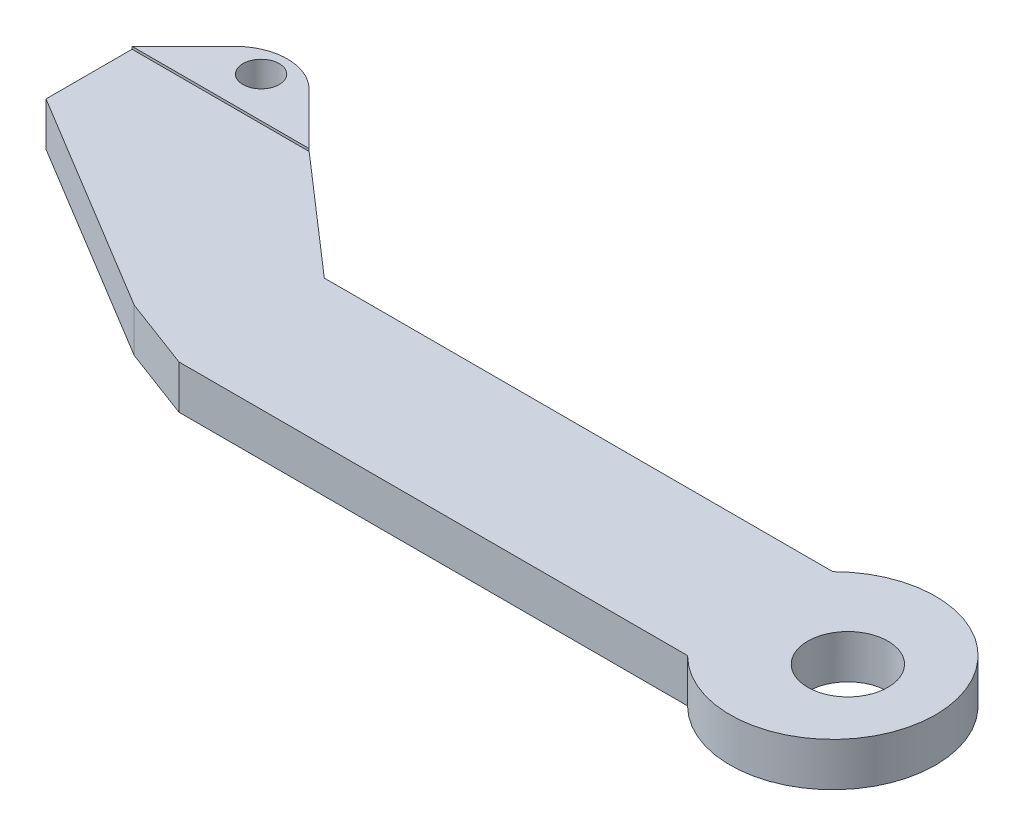
ISO-10303-21;
HEADER;
FILE_DESCRIPTION(('STEP AP214'),'2;1');
FILE_NAME('part.step','',(''),(''),'','','');
FILE_SCHEMA(('AUTOMOTIVE_DESIGN { 1 0 10303 214 1 1 1 1 }'));
ENDSEC;
DATA;
#1=APPLICATION_CONTEXT('core data for automotive mechanical design processes');
#2=APPLICATION_PROTOCOL_DEFINITION('international standard','automotive_design',2000,#1);
#3=PRODUCT_CONTEXT('',#1,'mechanical');
#4=PRODUCT('Part','Part','',(#3));
#5=PRODUCT_RELATED_PRODUCT_CATEGORY('part','',(#4));
#6=PRODUCT_DEFINITION_FORMATION('','',#4);
#7=PRODUCT_DEFINITION_CONTEXT('part definition',#1,'design');
#8=PRODUCT_DEFINITION('design','',#6,#7);
#9=PRODUCT_DEFINITION_SHAPE('','',#8);
#10=(LENGTH_UNIT() NAMED_UNIT(*) SI_UNIT(.MILLI.,.METRE.));
#11=(NAMED_UNIT(*) PLANE_ANGLE_UNIT() SI_UNIT($,.RADIAN.));
#12=(NAMED_UNIT(*) SI_UNIT($,.STERADIAN.) SOLID_ANGLE_UNIT());
#13=UNCERTAINTY_MEASURE_WITH_UNIT(LENGTH_MEASURE(1.E-05),#10,'distance_accuracy_value','');
#14=(GEOMETRIC_REPRESENTATION_CONTEXT(3) GLOBAL_UNCERTAINTY_ASSIGNED_CONTEXT((#13)) GLOBAL_UNIT_ASSIGNED_CONTEXT((#10,
#11,#12)) REPRESENTATION_CONTEXT('',''));
#15=CARTESIAN_POINT('',(0.,0.,0.));
#16=DIRECTION('',(0.,0.,1.));
#17=DIRECTION('',(1.,0.,0.));
#18=AXIS2_PLACEMENT_3D('',#15,#16,#17);
#19=CARTESIAN_POINT('',(70.,6.,-20.));
#20=DIRECTION('',(0.,0.,1.));
#21=DIRECTION('',(1.,0.,0.));
#22=AXIS2_PLACEMENT_3D('',#19,#20,#21);
#23=PLANE('',#22);
#24=DIRECTION('',(-1.,0.,0.));
#25=VECTOR('',#24,1.);
#26=CARTESIAN_POINT('',(70.,0.,-20.));
#27=LINE('',#26,#25);
#28=CARTESIAN_POINT('',(70.,0.,-20.));
#29=VERTEX_POINT('',#28);
#30=CARTESIAN_POINT('',(0.,0.,-20.));
#31=VERTEX_POINT('',#30);
#32=EDGE_CURVE('E132',#29,#31,#27,.T.);
#33=ORIENTED_EDGE('',*,*,#32,.T.);
#34=DIRECTION('',(0.,-1.,0.));
#35=VECTOR('',#34,1.);
#36=CARTESIAN_POINT('',(0.,6.,-20.));
#37=LINE('',#36,#35);
#38=CARTESIAN_POINT('',(0.,6.,-20.));
#39=VERTEX_POINT('',#38);
#40=EDGE_CURVE('E11',#39,#31,#37,.T.);
#41=ORIENTED_EDGE('',*,*,#40,.F.);
#42=DIRECTION('',(-1.,0.,0.));
#43=VECTOR('',#42,1.);
#44=CARTESIAN_POINT('',(70.,6.,-20.));
#45=LINE('',#44,#43);
#46=CARTESIAN_POINT('',(70.,6.,-20.));
#47=VERTEX_POINT('',#46);
#48=EDGE_CURVE('E146',#47,#39,#45,.T.);
#49=ORIENTED_EDGE('',*,*,#48,.F.);
#50=DIRECTION('',(0.,-1.,0.));
#51=VECTOR('',#50,1.);
#52=CARTESIAN_POINT('',(70.,6.,-20.));
#53=LINE('',#52,#51);
#54=EDGE_CURVE('E50',#47,#29,#53,.T.);
#55=ORIENTED_EDGE('',*,*,#54,.T.);
#56=EDGE_LOOP('',(#33,#41,#49,#55));
#57=FACE_BOUND('',#56,.T.);
#58=ADVANCED_FACE('F33',(#57),#23,.F.);
#59=CARTESIAN_POINT('',(0.,6.,-20.));
#60=DIRECTION('',(-0.656674069565782,0.,0.754174493310345));
#61=DIRECTION('',(0.754174493310345,0.,0.656674069565782));
#62=AXIS2_PLACEMENT_3D('',#59,#60,#61);
#63=PLANE('',#62);
#64=DIRECTION('',(-0.754174493310344,0.,-0.656674069565782));
#65=VECTOR('',#64,1.);
#66=CARTESIAN_POINT('',(0.,0.,-20.));
#67=LINE('',#66,#65);
#68=CARTESIAN_POINT('',(-16.1290992803304,0.,-34.0439133871459));
#69=VERTEX_POINT('',#68);
#70=EDGE_CURVE('E134',#31,#69,#67,.T.);
#71=ORIENTED_EDGE('',*,*,#70,.T.);
#72=DIRECTION('',(0.,-1.,0.));
#73=VECTOR('',#72,1.);
#74=CARTESIAN_POINT('',(-16.1290992803304,6.,-34.0439133871459));
#75=LINE('',#74,#73);
#76=CARTESIAN_POINT('',(-16.1290992803304,6.,-34.0439133871459));
#77=VERTEX_POINT('',#76);
#78=EDGE_CURVE('E42',#77,#69,#75,.T.);
#79=ORIENTED_EDGE('',*,*,#78,.F.);
#80=DIRECTION('',(-0.754174493310344,0.,-0.656674069565782));
#81=VECTOR('',#80,1.);
#82=CARTESIAN_POINT('',(0.,6.,-20.));
#83=LINE('',#82,#81);
#84=EDGE_CURVE('E90',#39,#77,#83,.T.);
#85=ORIENTED_EDGE('',*,*,#84,.F.);
#86=ORIENTED_EDGE('',*,*,#40,.T.);
#87=EDGE_LOOP('',(#71,#79,#85,#86));
#88=FACE_BOUND('',#87,.T.);
#89=ADVANCED_FACE('F228',(#88),#63,.F.);
#90=CARTESIAN_POINT('',(-40.5079542623739,6.,-34.0439133871459));
#91=DIRECTION('',(1.,0.,0.));
#92=DIRECTION('',(0.,0.,-1.));
#93=AXIS2_PLACEMENT_3D('',#90,#91,#92);
#94=PLANE('',#93);
#95=DIRECTION('',(0.,0.,1.));
#96=VECTOR('',#95,1.);
#97=CARTESIAN_POINT('',(-40.5079542623739,0.,-34.0439133871459));
#98=LINE('',#97,#96);
#99=CARTESIAN_POINT('',(-40.5079542623739,0.,-34.0439133871459));
#100=VERTEX_POINT('',#99);
#101=CARTESIAN_POINT('',(-40.5079542623739,0.,-22.1996269975087));
#102=VERTEX_POINT('',#101);
#103=EDGE_CURVE('E136',#100,#102,#98,.T.);
#104=ORIENTED_EDGE('',*,*,#103,.T.);
#105=DIRECTION('',(0.,-1.,0.));
#106=VECTOR('',#105,1.);
#107=CARTESIAN_POINT('',(-40.5079542623739,6.,-22.1996269975087));
#108=LINE('',#107,#106);
#109=CARTESIAN_POINT('',(-40.5079542623739,6.,-22.1996269975087));
#110=VERTEX_POINT('',#109);
#111=EDGE_CURVE('E150',#110,#102,#108,.T.);
#112=ORIENTED_EDGE('',*,*,#111,.F.);
#113=DIRECTION('',(0.,0.,1.));
#114=VECTOR('',#113,1.);
#115=CARTESIAN_POINT('',(-40.5079542623739,6.,-34.0439133871459));
#116=LINE('',#115,#114);
#117=CARTESIAN_POINT('',(-40.5079542623739,6.,-34.0439133871459));
#118=VERTEX_POINT('',#117);
#119=EDGE_CURVE('E206',#118,#110,#116,.T.);
#120=ORIENTED_EDGE('',*,*,#119,.F.);
#121=DIRECTION('',(0.,-1.,0.));
#122=VECTOR('',#121,1.);
#123=CARTESIAN_POINT('',(-40.5079542623739,6.,-34.0439133871459));
#124=LINE('',#123,#122);
#125=EDGE_CURVE('E153',#118,#100,#124,.T.);
#126=ORIENTED_EDGE('',*,*,#125,.T.);
#127=EDGE_LOOP('',(#104,#112,#120,#126));
#128=FACE_BOUND('',#127,.T.);
#129=ADVANCED_FACE('F211',(#128),#94,.F.);
#130=CARTESIAN_POINT('',(-40.5079542623739,6.,-22.1996269975087));
#131=DIRECTION('',(0.516906923938447,0.,-0.856041606456423));
#132=DIRECTION('',(-0.856041606456423,0.,-0.516906923938447));
#133=AXIS2_PLACEMENT_3D('',#130,#131,#132);
#134=PLANE('',#133);
#135=DIRECTION('',(0.856041606456423,0.,0.516906923938447));
#136=VECTOR('',#135,1.);
#137=CARTESIAN_POINT('',(-40.5079542623739,0.,-22.1996269975087));
#138=LINE('',#137,#136);
#139=CARTESIAN_POINT('',(-9.85011104348674,0.,-3.68738260034483));
#140=VERTEX_POINT('',#139);
#141=EDGE_CURVE('E138',#102,#140,#138,.T.);
#142=ORIENTED_EDGE('',*,*,#141,.T.);
#143=DIRECTION('',(0.,-1.,0.));
#144=VECTOR('',#143,1.);
#145=CARTESIAN_POINT('',(-9.85011104348674,6.,-3.68738260034483));
#146=LINE('',#145,#144);
#147=CARTESIAN_POINT('',(-9.85011104348674,6.,-3.68738260034483));
#148=VERTEX_POINT('',#147);
#149=EDGE_CURVE('E124',#148,#140,#146,.T.);
#150=ORIENTED_EDGE('',*,*,#149,.F.);
#151=DIRECTION('',(0.856041606456423,0.,0.516906923938447));
#152=VECTOR('',#151,1.);
#153=CARTESIAN_POINT('',(-40.5079542623739,6.,-22.1996269975087));
#154=LINE('',#153,#152);
#155=EDGE_CURVE('E112',#110,#148,#154,.T.);
#156=ORIENTED_EDGE('',*,*,#155,.F.);
#157=ORIENTED_EDGE('',*,*,#111,.T.);
#158=EDGE_LOOP('',(#142,#150,#156,#157));
#159=FACE_BOUND('',#158,.T.);
#160=ADVANCED_FACE('F215',(#159),#134,.F.);
#161=CARTESIAN_POINT('',(-9.85011104348674,6.,-3.68738260034483));
#162=DIRECTION('',(0.350589151778584,0.,-0.936529362409515));
#163=DIRECTION('',(-0.936529362409515,0.,-0.350589151778584));
#164=AXIS2_PLACEMENT_3D('',#161,#162,#163);
#165=PLANE('',#164);
#166=DIRECTION('',(0.936529362409515,0.,0.350589151778584));
#167=VECTOR('',#166,1.);
#168=CARTESIAN_POINT('',(-9.85011104348674,0.,-3.68738260034483));
#169=LINE('',#168,#167);
#170=CARTESIAN_POINT('',(0.,0.,0.));
#171=VERTEX_POINT('',#170);
#172=EDGE_CURVE('E121',#140,#171,#169,.T.);
#173=ORIENTED_EDGE('',*,*,#172,.T.);
#174=DIRECTION('',(0.,-1.,0.));
#175=VECTOR('',#174,1.);
#176=CARTESIAN_POINT('',(0.,6.,0.));
#177=LINE('',#176,#175);
#178=CARTESIAN_POINT('',(0.,6.,0.));
#179=VERTEX_POINT('',#178);
#180=EDGE_CURVE('E118',#179,#171,#177,.T.);
#181=ORIENTED_EDGE('',*,*,#180,.F.);
#182=DIRECTION('',(0.936529362409515,0.,0.350589151778584));
#183=VECTOR('',#182,1.);
#184=CARTESIAN_POINT('',(-9.85011104348674,6.,-3.68738260034483));
#185=LINE('',#184,#183);
#186=EDGE_CURVE('E105',#148,#179,#185,.T.);
#187=ORIENTED_EDGE('',*,*,#186,.F.);
#188=ORIENTED_EDGE('',*,*,#149,.T.);
#189=EDGE_LOOP('',(#173,#181,#187,#188));
#190=FACE_BOUND('',#189,.T.);
#191=ADVANCED_FACE('F119',(#190),#165,.F.);
#192=CARTESIAN_POINT('',(0.,6.,0.));
#193=DIRECTION('',(0.,0.,-1.));
#194=DIRECTION('',(-1.,0.,0.));
#195=AXIS2_PLACEMENT_3D('',#192,#193,#194);
#196=PLANE('',#195);
#197=DIRECTION('',(1.,0.,0.));
#198=VECTOR('',#197,1.);
#199=CARTESIAN_POINT('',(0.,0.,0.));
#200=LINE('',#199,#198);
#201=CARTESIAN_POINT('',(70.,0.,0.));
#202=VERTEX_POINT('',#201);
#203=EDGE_CURVE('E141',#171,#202,#200,.T.);
#204=ORIENTED_EDGE('',*,*,#203,.T.);
#205=DIRECTION('',(0.,-1.,0.));
#206=VECTOR('',#205,1.);
#207=CARTESIAN_POINT('',(70.,6.,0.));
#208=LINE('',#207,#206);
#209=CARTESIAN_POINT('',(70.,6.,0.));
#210=VERTEX_POINT('',#209);
#211=EDGE_CURVE('E78',#210,#202,#208,.T.);
#212=ORIENTED_EDGE('',*,*,#211,.F.);
#213=DIRECTION('',(1.,0.,0.));
#214=VECTOR('',#213,1.);
#215=CARTESIAN_POINT('',(0.,6.,0.));
#216=LINE('',#215,#214);
#217=EDGE_CURVE('E110',#179,#210,#216,.T.);
#218=ORIENTED_EDGE('',*,*,#217,.F.);
#219=ORIENTED_EDGE('',*,*,#180,.T.);
#220=EDGE_LOOP('',(#204,#212,#218,#219));
#221=FACE_BOUND('',#220,.T.);
#222=ADVANCED_FACE('F126',(#221),#196,.F.);
#223=CARTESIAN_POINT('',(80.,6.,-10.));
#224=DIRECTION('',(0.,-1.,0.));
#225=DIRECTION('',(0.,0.,-1.));
#226=AXIS2_PLACEMENT_3D('',#223,#224,#225);
#227=CYLINDRICAL_SURFACE('',#226,14.142135623731);
#228=CARTESIAN_POINT('',(80.,0.,-10.));
#229=DIRECTION('',(0.,-1.,0.));
#230=DIRECTION('',(0.,0.,-1.));
#231=AXIS2_PLACEMENT_3D('',#228,#229,#230);
#232=CIRCLE('',#231,14.142135623731);
#233=EDGE_CURVE('E143',#29,#202,#232,.T.);
#234=ORIENTED_EDGE('',*,*,#233,.F.);
#235=ORIENTED_EDGE('',*,*,#54,.F.);
#236=CARTESIAN_POINT('',(80.,6.,-10.));
#237=DIRECTION('',(0.,-1.,0.));
#238=DIRECTION('',(0.,0.,-1.));
#239=AXIS2_PLACEMENT_3D('',#236,#237,#238);
#240=CIRCLE('',#239,14.142135623731);
#241=EDGE_CURVE('E127',#47,#210,#240,.T.);
#242=ORIENTED_EDGE('',*,*,#241,.T.);
#243=ORIENTED_EDGE('',*,*,#211,.T.);
#244=EDGE_LOOP('',(#234,#235,#242,#243));
#245=FACE_BOUND('',#244,.T.);
#246=ADVANCED_FACE('F216',(#245),#227,.T.);
#247=CARTESIAN_POINT('',(80.,6.,-10.));
#248=DIRECTION('',(0.,-1.,0.));
#249=DIRECTION('',(0.,0.,-1.));
#250=AXIS2_PLACEMENT_3D('',#247,#248,#249);
#251=PLANE('',#250);
#252=CARTESIAN_POINT('',(82.0710678118655,6.,-10.));
#253=DIRECTION('',(0.,1.,0.));
#254=DIRECTION('',(0.,0.,1.));
#255=AXIS2_PLACEMENT_3D('',#252,#253,#254);
#256=CIRCLE('',#255,5.51790000000001);
#257=CARTESIAN_POINT('',(82.0710678118655,6.,-4.4821));
#258=VERTEX_POINT('',#257);
#259=EDGE_CURVE('E198',#258,#258,#256,.T.);
#260=ORIENTED_EDGE('',*,*,#259,.F.);
#261=EDGE_LOOP('',(#260));
#262=FACE_BOUND('',#261,.T.);
#263=ORIENTED_EDGE('',*,*,#48,.T.);
#264=ORIENTED_EDGE('',*,*,#84,.T.);
#265=DIRECTION('',(1.,0.,0.));
#266=VECTOR('',#265,1.);
#267=CARTESIAN_POINT('',(-40.5079542623739,6.,-34.0439133871459));
#268=LINE('',#267,#266);
#269=EDGE_CURVE('E203',#118,#77,#268,.T.);
#270=ORIENTED_EDGE('',*,*,#269,.F.);
#271=ORIENTED_EDGE('',*,*,#119,.T.);
#272=ORIENTED_EDGE('',*,*,#155,.T.);
#273=ORIENTED_EDGE('',*,*,#186,.T.);
#274=ORIENTED_EDGE('',*,*,#217,.T.);
#275=ORIENTED_EDGE('',*,*,#241,.F.);
#276=EDGE_LOOP('',(#263,#264,#270,#271,#272,#273,#274,#275));
#277=FACE_BOUND('',#276,.T.);
#278=ADVANCED_FACE('F107',(#262,#277),#251,.F.);
#279=CARTESIAN_POINT('',(80.,0.,-10.));
#280=DIRECTION('',(0.,-1.,0.));
#281=DIRECTION('',(0.,0.,-1.));
#282=AXIS2_PLACEMENT_3D('',#279,#280,#281);
#283=PLANE('',#282);
#284=CARTESIAN_POINT('',(82.0710678118655,0.,-10.));
#285=DIRECTION('',(0.,-1.,0.));
#286=DIRECTION('',(0.,0.,-1.));
#287=AXIS2_PLACEMENT_3D('',#284,#285,#286);
#288=CIRCLE('',#287,5.51790000000001);
#289=CARTESIAN_POINT('',(82.0710678118655,0.,-15.5179));
#290=VERTEX_POINT('',#289);
#291=EDGE_CURVE('E36',#290,#290,#288,.T.);
#292=ORIENTED_EDGE('',*,*,#291,.F.);
#293=EDGE_LOOP('',(#292));
#294=FACE_BOUND('',#293,.T.);
#295=ORIENTED_EDGE('',*,*,#32,.F.);
#296=ORIENTED_EDGE('',*,*,#233,.T.);
#297=ORIENTED_EDGE('',*,*,#203,.F.);
#298=ORIENTED_EDGE('',*,*,#172,.F.);
#299=ORIENTED_EDGE('',*,*,#141,.F.);
#300=ORIENTED_EDGE('',*,*,#103,.F.);
#301=DIRECTION('',(-0.707106781186551,0.,0.707106781186544));
#302=VECTOR('',#301,1.);
#303=CARTESIAN_POINT('',(-40.5079542623739,0.,-34.0439133871459));
#304=LINE('',#303,#302);
#305=CARTESIAN_POINT('',(-33.4368864505084,0.,-41.1149811990113));
#306=VERTEX_POINT('',#305);
#307=EDGE_CURVE('E177',#306,#100,#304,.T.);
#308=ORIENTED_EDGE('',*,*,#307,.F.);
#309=CARTESIAN_POINT('',(-28.3185267713521,0.,-35.9966215198552));
#310=DIRECTION('',(0.,1.,0.));
#311=DIRECTION('',(0.,0.,1.));
#312=AXIS2_PLACEMENT_3D('',#309,#310,#311);
#313=CIRCLE('',#312,7.2384536753663);
#314=CARTESIAN_POINT('',(-23.2001670921959,0.,-41.1149811990114));
#315=VERTEX_POINT('',#314);
#316=EDGE_CURVE('E174',#315,#306,#313,.T.);
#317=ORIENTED_EDGE('',*,*,#316,.F.);
#318=DIRECTION('',(-0.707106781186547,0.,-0.707106781186548));
#319=VECTOR('',#318,1.);
#320=CARTESIAN_POINT('',(-16.1290992803304,0.,-34.0439133871459));
#321=LINE('',#320,#319);
#322=EDGE_CURVE('E163',#69,#315,#321,.T.);
#323=ORIENTED_EDGE('',*,*,#322,.F.);
#324=ORIENTED_EDGE('',*,*,#70,.F.);
#325=EDGE_LOOP('',(#295,#296,#297,#298,#299,#300,#308,#317,#323,#324));
#326=FACE_BOUND('',#325,.T.);
#327=CARTESIAN_POINT('',(-28.3185267713521,0.,-39.6158483575383));
#328=DIRECTION('',(0.,1.,0.));
#329=DIRECTION('',(0.,0.,1.));
#330=AXIS2_PLACEMENT_3D('',#327,#328,#329);
#331=CIRCLE('',#330,2.5);
#332=CARTESIAN_POINT('',(-28.3185267713521,0.,-37.1158483575383));
#333=VERTEX_POINT('',#332);
#334=EDGE_CURVE('E180',#333,#333,#331,.T.);
#335=ORIENTED_EDGE('',*,*,#334,.T.);
#336=EDGE_LOOP('',(#335));
#337=FACE_BOUND('',#336,.T.);
#338=ADVANCED_FACE('F170',(#294,#326,#337),#283,.T.);
#339=CARTESIAN_POINT('',(82.0710678118655,-0.35,-10.));
#340=DIRECTION('',(0.,1.,0.));
#341=DIRECTION('',(0.,0.,1.));
#342=AXIS2_PLACEMENT_3D('',#339,#340,#341);
#343=CYLINDRICAL_SURFACE('',#342,5.51790000000001);
#344=ORIENTED_EDGE('',*,*,#291,.T.);
#345=EDGE_LOOP('',(#344));
#346=FACE_BOUND('',#345,.T.);
#347=ORIENTED_EDGE('',*,*,#259,.T.);
#348=EDGE_LOOP('',(#347));
#349=FACE_BOUND('',#348,.T.);
#350=ADVANCED_FACE('F286',(#346,#349),#343,.F.);
#351=CARTESIAN_POINT('',(-16.1290992803304,6.35,-34.0439133871459));
#352=DIRECTION('',(0.,0.,-1.));
#353=DIRECTION('',(-1.,0.,0.));
#354=AXIS2_PLACEMENT_3D('',#351,#352,#353);
#355=PLANE('',#354);
#356=DIRECTION('',(0.,-1.,0.));
#357=VECTOR('',#356,1.);
#358=CARTESIAN_POINT('',(-40.5079542623739,6.35,-34.0439133871459));
#359=LINE('',#358,#357);
#360=CARTESIAN_POINT('',(-40.5079542623739,6.35,-34.0439133871459));
#361=VERTEX_POINT('',#360);
#362=EDGE_CURVE('E189',#361,#118,#359,.T.);
#363=ORIENTED_EDGE('',*,*,#362,.T.);
#364=ORIENTED_EDGE('',*,*,#269,.T.);
#365=DIRECTION('',(0.,-1.,0.));
#366=VECTOR('',#365,1.);
#367=CARTESIAN_POINT('',(-16.1290992803304,6.35,-34.0439133871459));
#368=LINE('',#367,#366);
#369=CARTESIAN_POINT('',(-16.1290992803304,6.35,-34.0439133871459));
#370=VERTEX_POINT('',#369);
#371=EDGE_CURVE('E167',#370,#77,#368,.T.);
#372=ORIENTED_EDGE('',*,*,#371,.F.);
#373=DIRECTION('',(1.,0.,0.));
#374=VECTOR('',#373,1.);
#375=CARTESIAN_POINT('',(-16.1290992803304,6.35,-34.0439133871459));
#376=LINE('',#375,#374);
#377=EDGE_CURVE('E188',#361,#370,#376,.T.);
#378=ORIENTED_EDGE('',*,*,#377,.F.);
#379=EDGE_LOOP('',(#363,#364,#372,#378));
#380=FACE_BOUND('',#379,.T.);
#381=ADVANCED_FACE('F235',(#380),#355,.F.);
#382=CARTESIAN_POINT('',(-28.3185267713521,6.35,-35.9966215198552));
#383=DIRECTION('',(0.,1.,0.));
#384=DIRECTION('',(0.,0.,1.));
#385=AXIS2_PLACEMENT_3D('',#382,#383,#384);
#386=PLANE('',#385);
#387=ORIENTED_EDGE('',*,*,#377,.T.);
#388=DIRECTION('',(-0.707106781186547,0.,-0.707106781186548));
#389=VECTOR('',#388,1.);
#390=CARTESIAN_POINT('',(-16.1290992803304,6.35,-34.0439133871459));
#391=LINE('',#390,#389);
#392=CARTESIAN_POINT('',(-23.2001670921959,6.35,-41.1149811990114));
#393=VERTEX_POINT('',#392);
#394=EDGE_CURVE('E257',#370,#393,#391,.T.);
#395=ORIENTED_EDGE('',*,*,#394,.T.);
#396=CARTESIAN_POINT('',(-28.3185267713521,6.35,-35.9966215198552));
#397=DIRECTION('',(0.,1.,0.));
#398=DIRECTION('',(0.,0.,1.));
#399=AXIS2_PLACEMENT_3D('',#396,#397,#398);
#400=CIRCLE('',#399,7.2384536753663);
#401=CARTESIAN_POINT('',(-33.4368864505084,6.35,-41.1149811990113));
#402=VERTEX_POINT('',#401);
#403=EDGE_CURVE('E261',#393,#402,#400,.T.);
#404=ORIENTED_EDGE('',*,*,#403,.T.);
#405=DIRECTION('',(-0.707106781186551,0.,0.707106781186544));
#406=VECTOR('',#405,1.);
#407=CARTESIAN_POINT('',(-40.5079542623739,6.35,-34.0439133871459));
#408=LINE('',#407,#406);
#409=EDGE_CURVE('E183',#402,#361,#408,.T.);
#410=ORIENTED_EDGE('',*,*,#409,.T.);
#411=EDGE_LOOP('',(#387,#395,#404,#410));
#412=FACE_BOUND('',#411,.T.);
#413=CARTESIAN_POINT('',(-28.3185267713521,6.35,-39.6158483575383));
#414=DIRECTION('',(0.,1.,0.));
#415=DIRECTION('',(0.,0.,1.));
#416=AXIS2_PLACEMENT_3D('',#413,#414,#415);
#417=CIRCLE('',#416,2.5);
#418=CARTESIAN_POINT('',(-28.3185267713521,6.35,-37.1158483575383));
#419=VERTEX_POINT('',#418);
#420=EDGE_CURVE('E175',#419,#419,#417,.T.);
#421=ORIENTED_EDGE('',*,*,#420,.F.);
#422=EDGE_LOOP('',(#421));
#423=FACE_BOUND('',#422,.T.);
#424=ADVANCED_FACE('F258',(#412,#423),#386,.T.);
#425=CARTESIAN_POINT('',(-16.1290992803304,6.35,-34.0439133871459));
#426=DIRECTION('',(-0.707106781186548,0.,0.707106781186547));
#427=DIRECTION('',(0.707106781186547,0.,0.707106781186548));
#428=AXIS2_PLACEMENT_3D('',#425,#426,#427);
#429=PLANE('',#428);
#430=ORIENTED_EDGE('',*,*,#322,.T.);
#431=DIRECTION('',(0.,-1.,0.));
#432=VECTOR('',#431,1.);
#433=CARTESIAN_POINT('',(-23.2001670921959,6.35,-41.1149811990114));
#434=LINE('',#433,#432);
#435=EDGE_CURVE('E195',#393,#315,#434,.T.);
#436=ORIENTED_EDGE('',*,*,#435,.F.);
#437=ORIENTED_EDGE('',*,*,#394,.F.);
#438=ORIENTED_EDGE('',*,*,#371,.T.);
#439=ORIENTED_EDGE('',*,*,#78,.T.);
#440=EDGE_LOOP('',(#430,#436,#437,#438,#439));
#441=FACE_BOUND('',#440,.T.);
#442=ADVANCED_FACE('F160',(#441),#429,.F.);
#443=CARTESIAN_POINT('',(-28.3185267713521,6.35,-35.9966215198552));
#444=DIRECTION('',(0.,-1.,0.));
#445=DIRECTION('',(0.,0.,-1.));
#446=AXIS2_PLACEMENT_3D('',#443,#444,#445);
#447=CYLINDRICAL_SURFACE('',#446,7.2384536753663);
#448=ORIENTED_EDGE('',*,*,#316,.T.);
#449=DIRECTION('',(0.,-1.,0.));
#450=VECTOR('',#449,1.);
#451=CARTESIAN_POINT('',(-33.4368864505084,6.35,-41.1149811990113));
#452=LINE('',#451,#450);
#453=EDGE_CURVE('E192',#402,#306,#452,.T.);
#454=ORIENTED_EDGE('',*,*,#453,.F.);
#455=ORIENTED_EDGE('',*,*,#403,.F.);
#456=ORIENTED_EDGE('',*,*,#435,.T.);
#457=EDGE_LOOP('',(#448,#454,#455,#456));
#458=FACE_BOUND('',#457,.T.);
#459=ADVANCED_FACE('F263',(#458),#447,.T.);
#460=CARTESIAN_POINT('',(-40.5079542623739,6.35,-34.0439133871459));
#461=DIRECTION('',(0.707106781186544,0.,0.707106781186551));
#462=DIRECTION('',(0.707106781186551,0.,-0.707106781186544));
#463=AXIS2_PLACEMENT_3D('',#460,#461,#462);
#464=PLANE('',#463);
#465=ORIENTED_EDGE('',*,*,#307,.T.);
#466=ORIENTED_EDGE('',*,*,#125,.F.);
#467=ORIENTED_EDGE('',*,*,#362,.F.);
#468=ORIENTED_EDGE('',*,*,#409,.F.);
#469=ORIENTED_EDGE('',*,*,#453,.T.);
#470=EDGE_LOOP('',(#465,#466,#467,#468,#469));
#471=FACE_BOUND('',#470,.T.);
#472=ADVANCED_FACE('F242',(#471),#464,.F.);
#473=CARTESIAN_POINT('',(-28.3185267713521,6.35,-39.6158483575383));
#474=DIRECTION('',(0.,-1.,0.));
#475=DIRECTION('',(0.,0.,-1.));
#476=AXIS2_PLACEMENT_3D('',#473,#474,#475);
#477=CYLINDRICAL_SURFACE('',#476,2.5);
#478=ORIENTED_EDGE('',*,*,#420,.T.);
#479=EDGE_LOOP('',(#478));
#480=FACE_BOUND('',#479,.T.);
#481=ORIENTED_EDGE('',*,*,#334,.F.);
#482=EDGE_LOOP('',(#481));
#483=FACE_BOUND('',#482,.T.);
#484=ADVANCED_FACE('F269',(#480,#483),#477,.F.);
#485=CLOSED_SHELL('',(#58,#89,#129,#160,#191,#222,#246,#278,#338,#350,#381,#424,#442,#459,#472,#484));
#486=MANIFOLD_SOLID_BREP('B2',#485);
#487=ADVANCED_BREP_SHAPE_REPRESENTATION('',(#18,#486),#14);
#488=SHAPE_DEFINITION_REPRESENTATION(#9,#487);
ENDSEC;
END-ISO-10303-21;
